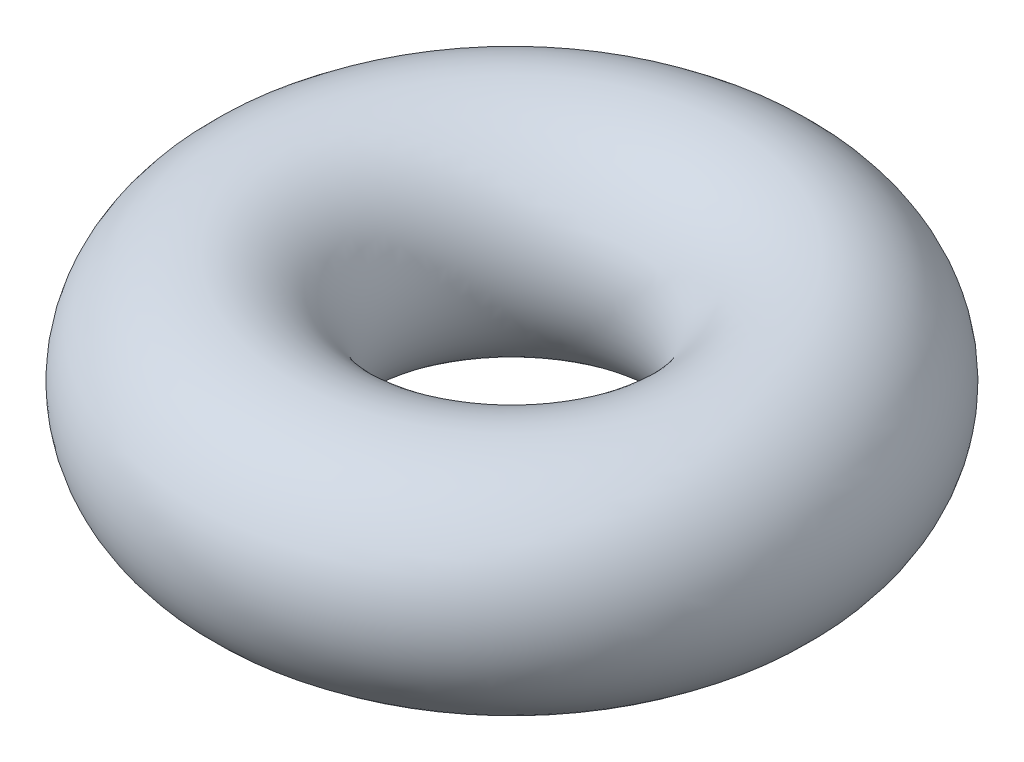
ISO-10303-21;
HEADER;
FILE_DESCRIPTION(('STEP AP214'),'2;1');
FILE_NAME('part.step','',(''),(''),'','','');
FILE_SCHEMA(('AUTOMOTIVE_DESIGN { 1 0 10303 214 1 1 1 1 }'));
ENDSEC;
DATA;
#1=APPLICATION_CONTEXT('core data for automotive mechanical design processes');
#2=APPLICATION_PROTOCOL_DEFINITION('international standard','automotive_design',2000,#1);
#3=PRODUCT_CONTEXT('',#1,'mechanical');
#4=PRODUCT('Part','Part','',(#3));
#5=PRODUCT_RELATED_PRODUCT_CATEGORY('part','',(#4));
#6=PRODUCT_DEFINITION_FORMATION('','',#4);
#7=PRODUCT_DEFINITION_CONTEXT('part definition',#1,'design');
#8=PRODUCT_DEFINITION('design','',#6,#7);
#9=PRODUCT_DEFINITION_SHAPE('','',#8);
#10=(LENGTH_UNIT() NAMED_UNIT(*) SI_UNIT(.MILLI.,.METRE.));
#11=(NAMED_UNIT(*) PLANE_ANGLE_UNIT() SI_UNIT($,.RADIAN.));
#12=(NAMED_UNIT(*) SI_UNIT($,.STERADIAN.) SOLID_ANGLE_UNIT());
#13=UNCERTAINTY_MEASURE_WITH_UNIT(LENGTH_MEASURE(1.E-05),#10,'distance_accuracy_value','');
#14=(GEOMETRIC_REPRESENTATION_CONTEXT(3) GLOBAL_UNCERTAINTY_ASSIGNED_CONTEXT((#13)) GLOBAL_UNIT_ASSIGNED_CONTEXT((#10,
#11,#12)) REPRESENTATION_CONTEXT('',''));
#15=CARTESIAN_POINT('',(0.,0.,0.));
#16=DIRECTION('',(0.,0.,1.));
#17=DIRECTION('',(1.,0.,0.));
#18=AXIS2_PLACEMENT_3D('',#15,#16,#17);
#19=CARTESIAN_POINT('',(0.,0.,0.));
#20=DIRECTION('',(0.,-1.,0.));
#21=DIRECTION('',(0.,0.,-1.));
#22=AXIS2_PLACEMENT_3D('',#19,#20,#21);
#23=TOROIDAL_SURFACE('',#22,121.,60.5);
#24=CARTESIAN_POINT('',(0.,0.,-181.5));
#25=VERTEX_POINT('',#24);
#26=VERTEX_LOOP('',#25);
#27=FACE_BOUND('',#26,.T.);
#28=ADVANCED_FACE('F28',(#27),#23,.T.);
#29=CLOSED_SHELL('',(#28));
#30=MANIFOLD_SOLID_BREP('B2',#29);
#31=ADVANCED_BREP_SHAPE_REPRESENTATION('',(#18,#30),#14);
#32=SHAPE_DEFINITION_REPRESENTATION(#9,#31);
ENDSEC;
END-ISO-10303-21;
